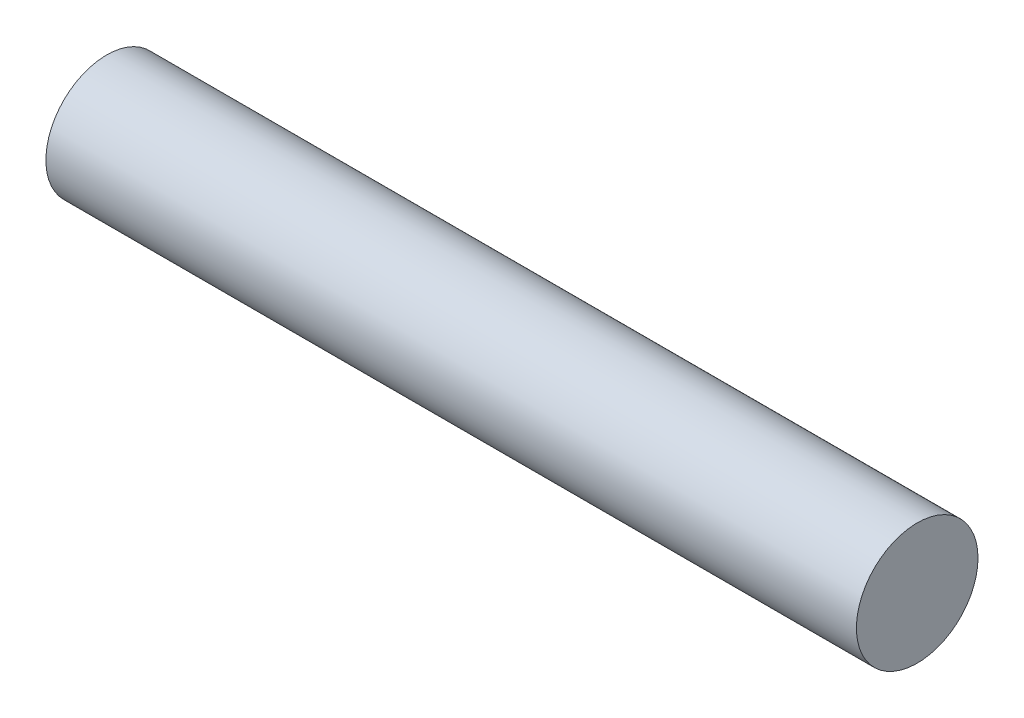
ISO-10303-21;
HEADER;
FILE_DESCRIPTION(('STEP AP214'),'2;1');
FILE_NAME('part.step','',(''),(''),'','','');
FILE_SCHEMA(('AUTOMOTIVE_DESIGN { 1 0 10303 214 1 1 1 1 }'));
ENDSEC;
DATA;
#1=APPLICATION_CONTEXT('core data for automotive mechanical design processes');
#2=APPLICATION_PROTOCOL_DEFINITION('international standard','automotive_design',2000,#1);
#3=PRODUCT_CONTEXT('',#1,'mechanical');
#4=PRODUCT('Part','Part','',(#3));
#5=PRODUCT_RELATED_PRODUCT_CATEGORY('part','',(#4));
#6=PRODUCT_DEFINITION_FORMATION('','',#4);
#7=PRODUCT_DEFINITION_CONTEXT('part definition',#1,'design');
#8=PRODUCT_DEFINITION('design','',#6,#7);
#9=PRODUCT_DEFINITION_SHAPE('','',#8);
#10=(LENGTH_UNIT() NAMED_UNIT(*) SI_UNIT(.MILLI.,.METRE.));
#11=(NAMED_UNIT(*) PLANE_ANGLE_UNIT() SI_UNIT($,.RADIAN.));
#12=(NAMED_UNIT(*) SI_UNIT($,.STERADIAN.) SOLID_ANGLE_UNIT());
#13=UNCERTAINTY_MEASURE_WITH_UNIT(LENGTH_MEASURE(1.E-05),#10,'distance_accuracy_value','');
#14=(GEOMETRIC_REPRESENTATION_CONTEXT(3) GLOBAL_UNCERTAINTY_ASSIGNED_CONTEXT((#13)) GLOBAL_UNIT_ASSIGNED_CONTEXT((#10,
#11,#12)) REPRESENTATION_CONTEXT('',''));
#15=CARTESIAN_POINT('',(0.,0.,0.));
#16=DIRECTION('',(0.,0.,1.));
#17=DIRECTION('',(1.,0.,0.));
#18=AXIS2_PLACEMENT_3D('',#15,#16,#17);
#19=CARTESIAN_POINT('',(127.,0.,0.));
#20=DIRECTION('',(-1.,0.,0.));
#21=DIRECTION('',(0.,0.,1.));
#22=AXIS2_PLACEMENT_3D('',#19,#20,#21);
#23=CYLINDRICAL_SURFACE('',#22,9.525);
#24=CARTESIAN_POINT('',(127.,0.,0.));
#25=DIRECTION('',(1.,0.,0.));
#26=DIRECTION('',(0.,0.,-1.));
#27=AXIS2_PLACEMENT_3D('',#24,#25,#26);
#28=CIRCLE('',#27,9.525);
#29=CARTESIAN_POINT('',(127.,0.,-9.525));
#30=VERTEX_POINT('',#29);
#31=EDGE_CURVE('E10',#30,#30,#28,.T.);
#32=ORIENTED_EDGE('',*,*,#31,.F.);
#33=EDGE_LOOP('',(#32));
#34=FACE_BOUND('',#33,.T.);
#35=CARTESIAN_POINT('',(0.,0.,0.));
#36=DIRECTION('',(1.,0.,0.));
#37=DIRECTION('',(0.,0.,-1.));
#38=AXIS2_PLACEMENT_3D('',#35,#36,#37);
#39=CIRCLE('',#38,9.525);
#40=CARTESIAN_POINT('',(0.,0.,-9.525));
#41=VERTEX_POINT('',#40);
#42=EDGE_CURVE('E33',#41,#41,#39,.T.);
#43=ORIENTED_EDGE('',*,*,#42,.T.);
#44=EDGE_LOOP('',(#43));
#45=FACE_BOUND('',#44,.T.);
#46=ADVANCED_FACE('F30',(#34,#45),#23,.T.);
#47=CARTESIAN_POINT('',(127.,0.,0.));
#48=DIRECTION('',(1.,0.,0.));
#49=DIRECTION('',(0.,0.,-1.));
#50=AXIS2_PLACEMENT_3D('',#47,#48,#49);
#51=PLANE('',#50);
#52=ORIENTED_EDGE('',*,*,#31,.T.);
#53=EDGE_LOOP('',(#52));
#54=FACE_BOUND('',#53,.T.);
#55=ADVANCED_FACE('F45',(#54),#51,.T.);
#56=CARTESIAN_POINT('',(0.,0.,0.));
#57=DIRECTION('',(1.,0.,0.));
#58=DIRECTION('',(0.,0.,-1.));
#59=AXIS2_PLACEMENT_3D('',#56,#57,#58);
#60=PLANE('',#59);
#61=ORIENTED_EDGE('',*,*,#42,.F.);
#62=EDGE_LOOP('',(#61));
#63=FACE_BOUND('',#62,.T.);
#64=ADVANCED_FACE('F43',(#63),#60,.F.);
#65=CLOSED_SHELL('',(#46,#55,#64));
#66=MANIFOLD_SOLID_BREP('B2',#65);
#67=ADVANCED_BREP_SHAPE_REPRESENTATION('',(#18,#66),#14);
#68=SHAPE_DEFINITION_REPRESENTATION(#9,#67);
ENDSEC;
END-ISO-10303-21;
